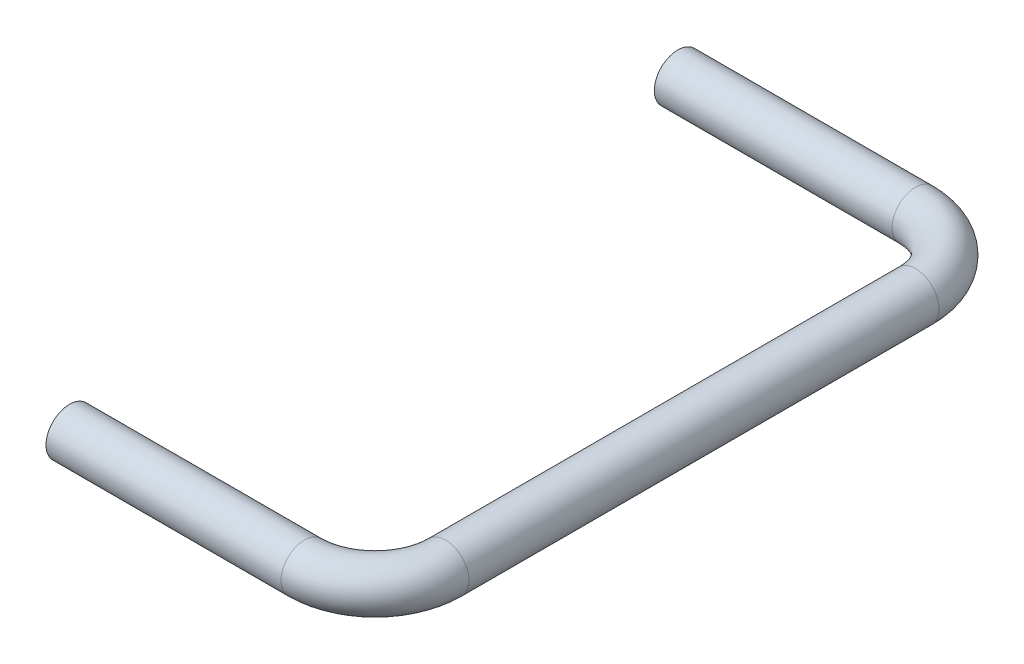
ISO-10303-21;
HEADER;
FILE_DESCRIPTION(('STEP AP214'),'2;1');
FILE_NAME('part.step','',(''),(''),'','','');
FILE_SCHEMA(('AUTOMOTIVE_DESIGN { 1 0 10303 214 1 1 1 1 }'));
ENDSEC;
DATA;
#1=APPLICATION_CONTEXT('core data for automotive mechanical design processes');
#2=APPLICATION_PROTOCOL_DEFINITION('international standard','automotive_design',2000,#1);
#3=PRODUCT_CONTEXT('',#1,'mechanical');
#4=PRODUCT('Part','Part','',(#3));
#5=PRODUCT_RELATED_PRODUCT_CATEGORY('part','',(#4));
#6=PRODUCT_DEFINITION_FORMATION('','',#4);
#7=PRODUCT_DEFINITION_CONTEXT('part definition',#1,'design');
#8=PRODUCT_DEFINITION('design','',#6,#7);
#9=PRODUCT_DEFINITION_SHAPE('','',#8);
#10=(LENGTH_UNIT() NAMED_UNIT(*) SI_UNIT(.MILLI.,.METRE.));
#11=(NAMED_UNIT(*) PLANE_ANGLE_UNIT() SI_UNIT($,.RADIAN.));
#12=(NAMED_UNIT(*) SI_UNIT($,.STERADIAN.) SOLID_ANGLE_UNIT());
#13=UNCERTAINTY_MEASURE_WITH_UNIT(LENGTH_MEASURE(1.E-05),#10,'distance_accuracy_value','');
#14=(GEOMETRIC_REPRESENTATION_CONTEXT(3) GLOBAL_UNCERTAINTY_ASSIGNED_CONTEXT((#13)) GLOBAL_UNIT_ASSIGNED_CONTEXT((#10,
#11,#12)) REPRESENTATION_CONTEXT('',''));
#15=CARTESIAN_POINT('',(0.,0.,0.));
#16=DIRECTION('',(0.,0.,1.));
#17=DIRECTION('',(1.,0.,0.));
#18=AXIS2_PLACEMENT_3D('',#15,#16,#17);
#19=CARTESIAN_POINT('',(10.,0.,-26.));
#20=DIRECTION('',(-1.,0.,0.));
#21=DIRECTION('',(0.,0.,1.));
#22=AXIS2_PLACEMENT_3D('',#19,#20,#21);
#23=CYLINDRICAL_SURFACE('',#22,1.);
#24=CARTESIAN_POINT('',(10.,0.,-26.));
#25=DIRECTION('',(-1.,0.,0.));
#26=DIRECTION('',(0.,0.,1.));
#27=AXIS2_PLACEMENT_3D('',#24,#25,#26);
#28=CIRCLE('',#27,1.);
#29=CARTESIAN_POINT('',(10.,0.,-27.));
#30=VERTEX_POINT('',#29);
#31=EDGE_CURVE('E38',#30,#30,#28,.T.);
#32=ORIENTED_EDGE('',*,*,#31,.T.);
#33=EDGE_LOOP('',(#32));
#34=FACE_BOUND('',#33,.T.);
#35=CARTESIAN_POINT('',(-0.116555463762325,0.,-26.));
#36=DIRECTION('',(-1.,0.,0.));
#37=DIRECTION('',(0.,0.,1.));
#38=AXIS2_PLACEMENT_3D('',#35,#36,#37);
#39=CIRCLE('',#38,1.);
#40=CARTESIAN_POINT('',(-0.116555463762325,0.,-25.));
#41=VERTEX_POINT('',#40);
#42=EDGE_CURVE('E10',#41,#41,#39,.T.);
#43=ORIENTED_EDGE('',*,*,#42,.F.);
#44=EDGE_LOOP('',(#43));
#45=FACE_BOUND('',#44,.T.);
#46=ADVANCED_FACE('F32',(#34,#45),#23,.T.);
#47=CARTESIAN_POINT('',(10.,0.,-23.));
#48=DIRECTION('',(0.,1.,0.));
#49=DIRECTION('',(0.,0.,1.));
#50=AXIS2_PLACEMENT_3D('',#47,#48,#49);
#51=TOROIDAL_SURFACE('',#50,3.,1.);
#52=CARTESIAN_POINT('',(13.,0.,-23.));
#53=DIRECTION('',(0.,0.,-1.));
#54=DIRECTION('',(-1.,0.,0.));
#55=AXIS2_PLACEMENT_3D('',#52,#53,#54);
#56=CIRCLE('',#55,1.);
#57=CARTESIAN_POINT('',(14.,0.,-23.));
#58=VERTEX_POINT('',#57);
#59=EDGE_CURVE('E42',#58,#58,#56,.T.);
#60=CARTESIAN_POINT('',(10.,0.,-23.));
#61=DIRECTION('',(0.,1.,0.));
#62=DIRECTION('',(0.,0.,1.));
#63=AXIS2_PLACEMENT_3D('',#60,#61,#62);
#64=CIRCLE('',#63,4.);
#65=EDGE_CURVE('',#58,#30,#64,.T.);
#66=ORIENTED_EDGE('',*,*,#59,.T.);
#67=ORIENTED_EDGE('',*,*,#31,.F.);
#68=ORIENTED_EDGE('',*,*,#65,.T.);
#69=ORIENTED_EDGE('',*,*,#65,.F.);
#70=EDGE_LOOP('',(#66,#68,#67,#69));
#71=FACE_BOUND('',#70,.T.);
#72=ADVANCED_FACE('F76',(#71),#51,.T.);
#73=CARTESIAN_POINT('',(13.,0.,-3.));
#74=DIRECTION('',(0.,0.,-1.));
#75=DIRECTION('',(-1.,0.,0.));
#76=AXIS2_PLACEMENT_3D('',#73,#74,#75);
#77=CYLINDRICAL_SURFACE('',#76,1.);
#78=CARTESIAN_POINT('',(13.,0.,-3.));
#79=DIRECTION('',(0.,0.,-1.));
#80=DIRECTION('',(-1.,0.,0.));
#81=AXIS2_PLACEMENT_3D('',#78,#79,#80);
#82=CIRCLE('',#81,1.);
#83=CARTESIAN_POINT('',(14.,0.,-3.));
#84=VERTEX_POINT('',#83);
#85=EDGE_CURVE('E46',#84,#84,#82,.T.);
#86=ORIENTED_EDGE('',*,*,#85,.T.);
#87=EDGE_LOOP('',(#86));
#88=FACE_BOUND('',#87,.T.);
#89=ORIENTED_EDGE('',*,*,#59,.F.);
#90=EDGE_LOOP('',(#89));
#91=FACE_BOUND('',#90,.T.);
#92=ADVANCED_FACE('F80',(#88,#91),#77,.T.);
#93=CARTESIAN_POINT('',(10.,0.,-3.));
#94=DIRECTION('',(0.,1.,0.));
#95=DIRECTION('',(0.,0.,1.));
#96=AXIS2_PLACEMENT_3D('',#93,#94,#95);
#97=TOROIDAL_SURFACE('',#96,3.,1.);
#98=CARTESIAN_POINT('',(10.,0.,0.));
#99=DIRECTION('',(1.,0.,0.));
#100=DIRECTION('',(0.,0.,-1.));
#101=AXIS2_PLACEMENT_3D('',#98,#99,#100);
#102=CIRCLE('',#101,1.);
#103=CARTESIAN_POINT('',(10.,0.,1.));
#104=VERTEX_POINT('',#103);
#105=EDGE_CURVE('E51',#104,#104,#102,.T.);
#106=CARTESIAN_POINT('',(10.,0.,-3.));
#107=DIRECTION('',(0.,1.,0.));
#108=DIRECTION('',(0.,0.,1.));
#109=AXIS2_PLACEMENT_3D('',#106,#107,#108);
#110=CIRCLE('',#109,4.);
#111=EDGE_CURVE('',#104,#84,#110,.T.);
#112=ORIENTED_EDGE('',*,*,#105,.T.);
#113=ORIENTED_EDGE('',*,*,#85,.F.);
#114=ORIENTED_EDGE('',*,*,#111,.T.);
#115=ORIENTED_EDGE('',*,*,#111,.F.);
#116=EDGE_LOOP('',(#112,#114,#113,#115));
#117=FACE_BOUND('',#116,.T.);
#118=ADVANCED_FACE('F58',(#117),#97,.T.);
#119=CARTESIAN_POINT('',(10.,0.,0.));
#120=DIRECTION('',(-1.,0.,0.));
#121=DIRECTION('',(0.,0.,1.));
#122=AXIS2_PLACEMENT_3D('',#119,#120,#121);
#123=CYLINDRICAL_SURFACE('',#122,1.);
#124=ORIENTED_EDGE('',*,*,#105,.F.);
#125=EDGE_LOOP('',(#124));
#126=FACE_BOUND('',#125,.T.);
#127=CARTESIAN_POINT('',(0.,0.,0.));
#128=DIRECTION('',(1.,0.,0.));
#129=DIRECTION('',(0.,0.,-1.));
#130=AXIS2_PLACEMENT_3D('',#127,#128,#129);
#131=CIRCLE('',#130,1.);
#132=CARTESIAN_POINT('',(0.,0.,-1.));
#133=VERTEX_POINT('',#132);
#134=EDGE_CURVE('E52',#133,#133,#131,.T.);
#135=ORIENTED_EDGE('',*,*,#134,.T.);
#136=EDGE_LOOP('',(#135));
#137=FACE_BOUND('',#136,.T.);
#138=ADVANCED_FACE('F61',(#126,#137),#123,.T.);
#139=CARTESIAN_POINT('',(-0.116555463762325,0.,-26.));
#140=DIRECTION('',(-1.,0.,0.));
#141=DIRECTION('',(0.,0.,1.));
#142=AXIS2_PLACEMENT_3D('',#139,#140,#141);
#143=PLANE('',#142);
#144=ORIENTED_EDGE('',*,*,#42,.T.);
#145=EDGE_LOOP('',(#144));
#146=FACE_BOUND('',#145,.T.);
#147=ADVANCED_FACE('F64',(#146),#143,.T.);
#148=CARTESIAN_POINT('',(0.,0.,0.));
#149=DIRECTION('',(1.,0.,0.));
#150=DIRECTION('',(0.,0.,-1.));
#151=AXIS2_PLACEMENT_3D('',#148,#149,#150);
#152=PLANE('',#151);
#153=ORIENTED_EDGE('',*,*,#134,.F.);
#154=EDGE_LOOP('',(#153));
#155=FACE_BOUND('',#154,.T.);
#156=ADVANCED_FACE('F68',(#155),#152,.F.);
#157=CLOSED_SHELL('',(#46,#72,#92,#118,#138,#147,#156));
#158=MANIFOLD_SOLID_BREP('B2',#157);
#159=ADVANCED_BREP_SHAPE_REPRESENTATION('',(#18,#158),#14);
#160=SHAPE_DEFINITION_REPRESENTATION(#9,#159);
ENDSEC;
END-ISO-10303-21;
